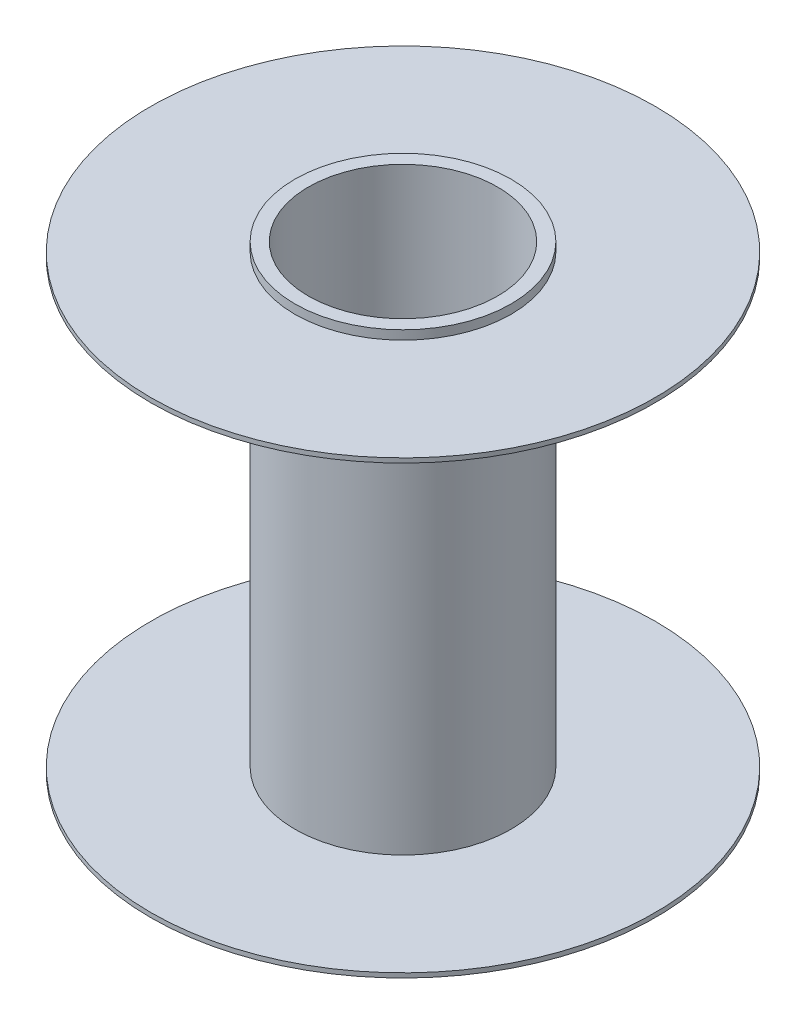
ISO-10303-21;
HEADER;
FILE_DESCRIPTION(('STEP AP214'),'2;1');
FILE_NAME('part.step','',(''),(''),'','','');
FILE_SCHEMA(('AUTOMOTIVE_DESIGN { 1 0 10303 214 1 1 1 1 }'));
ENDSEC;
DATA;
#1=APPLICATION_CONTEXT('core data for automotive mechanical design processes');
#2=APPLICATION_PROTOCOL_DEFINITION('international standard','automotive_design',2000,#1);
#3=PRODUCT_CONTEXT('',#1,'mechanical');
#4=PRODUCT('Part','Part','',(#3));
#5=PRODUCT_RELATED_PRODUCT_CATEGORY('part','',(#4));
#6=PRODUCT_DEFINITION_FORMATION('','',#4);
#7=PRODUCT_DEFINITION_CONTEXT('part definition',#1,'design');
#8=PRODUCT_DEFINITION('design','',#6,#7);
#9=PRODUCT_DEFINITION_SHAPE('','',#8);
#10=(LENGTH_UNIT() NAMED_UNIT(*) SI_UNIT(.MILLI.,.METRE.));
#11=(NAMED_UNIT(*) PLANE_ANGLE_UNIT() SI_UNIT($,.RADIAN.));
#12=(NAMED_UNIT(*) SI_UNIT($,.STERADIAN.) SOLID_ANGLE_UNIT());
#13=UNCERTAINTY_MEASURE_WITH_UNIT(LENGTH_MEASURE(1.E-05),#10,'distance_accuracy_value','');
#14=(GEOMETRIC_REPRESENTATION_CONTEXT(3) GLOBAL_UNCERTAINTY_ASSIGNED_CONTEXT((#13)) GLOBAL_UNIT_ASSIGNED_CONTEXT((#10,
#11,#12)) REPRESENTATION_CONTEXT('',''));
#15=CARTESIAN_POINT('',(0.,0.,0.));
#16=DIRECTION('',(0.,0.,1.));
#17=DIRECTION('',(1.,0.,0.));
#18=AXIS2_PLACEMENT_3D('',#15,#16,#17);
#19=CARTESIAN_POINT('',(0.,0.2,0.));
#20=DIRECTION('',(0.,-1.,0.));
#21=DIRECTION('',(0.,0.,-1.));
#22=AXIS2_PLACEMENT_3D('',#19,#20,#21);
#23=CYLINDRICAL_SURFACE('',#22,2.4);
#24=CARTESIAN_POINT('',(0.,0.2,0.));
#25=DIRECTION('',(0.,1.,0.));
#26=DIRECTION('',(0.,0.,1.));
#27=AXIS2_PLACEMENT_3D('',#24,#25,#26);
#28=CIRCLE('',#27,2.4);
#29=CARTESIAN_POINT('',(0.,0.2,2.4));
#30=VERTEX_POINT('',#29);
#31=EDGE_CURVE('E39',#30,#30,#28,.T.);
#32=ORIENTED_EDGE('',*,*,#31,.F.);
#33=EDGE_LOOP('',(#32));
#34=FACE_BOUND('',#33,.T.);
#35=CARTESIAN_POINT('',(0.,0.,0.));
#36=DIRECTION('',(0.,-1.,0.));
#37=DIRECTION('',(0.,0.,-1.));
#38=AXIS2_PLACEMENT_3D('',#35,#36,#37);
#39=CIRCLE('',#38,2.4);
#40=CARTESIAN_POINT('',(0.,0.,-2.4));
#41=VERTEX_POINT('',#40);
#42=EDGE_CURVE('E10',#41,#41,#39,.T.);
#43=ORIENTED_EDGE('',*,*,#42,.F.);
#44=EDGE_LOOP('',(#43));
#45=FACE_BOUND('',#44,.T.);
#46=ADVANCED_FACE('F31',(#34,#45),#23,.T.);
#47=CARTESIAN_POINT('',(0.,0.2,0.));
#48=DIRECTION('',(0.,1.,0.));
#49=DIRECTION('',(0.,0.,1.));
#50=AXIS2_PLACEMENT_3D('',#47,#48,#49);
#51=PLANE('',#50);
#52=ORIENTED_EDGE('',*,*,#31,.T.);
#53=EDGE_LOOP('',(#52));
#54=FACE_BOUND('',#53,.T.);
#55=CARTESIAN_POINT('',(0.,0.2,0.));
#56=DIRECTION('',(0.,1.,0.));
#57=DIRECTION('',(0.,0.,1.));
#58=AXIS2_PLACEMENT_3D('',#55,#56,#57);
#59=CIRCLE('',#58,2.1);
#60=CARTESIAN_POINT('',(0.,0.2,2.1));
#61=VERTEX_POINT('',#60);
#62=EDGE_CURVE('E43',#61,#61,#59,.T.);
#63=ORIENTED_EDGE('',*,*,#62,.F.);
#64=EDGE_LOOP('',(#63));
#65=FACE_BOUND('',#64,.T.);
#66=ADVANCED_FACE('F92',(#54,#65),#51,.T.);
#67=CARTESIAN_POINT('',(0.,-0.1,0.));
#68=DIRECTION('',(0.,-1.,0.));
#69=DIRECTION('',(0.,0.,-1.));
#70=AXIS2_PLACEMENT_3D('',#67,#68,#69);
#71=CIRCLE('',#70,2.4);
#72=CARTESIAN_POINT('',(0.,-0.1,-2.4));
#73=VERTEX_POINT('',#72);
#74=EDGE_CURVE('E35',#73,#73,#71,.T.);
#75=ORIENTED_EDGE('',*,*,#74,.T.);
#76=EDGE_LOOP('',(#75));
#77=FACE_BOUND('',#76,.T.);
#78=CARTESIAN_POINT('',(0.,-9.9,0.));
#79=DIRECTION('',(0.,-1.,0.));
#80=DIRECTION('',(0.,0.,-1.));
#81=AXIS2_PLACEMENT_3D('',#78,#79,#80);
#82=CIRCLE('',#81,2.4);
#83=CARTESIAN_POINT('',(0.,-9.9,-2.4));
#84=VERTEX_POINT('',#83);
#85=EDGE_CURVE('E55',#84,#84,#82,.T.);
#86=ORIENTED_EDGE('',*,*,#85,.F.);
#87=EDGE_LOOP('',(#86));
#88=FACE_BOUND('',#87,.T.);
#89=ADVANCED_FACE('F33',(#77,#88),#23,.T.);
#90=CARTESIAN_POINT('',(0.,0.2,0.));
#91=DIRECTION('',(0.,-1.,0.));
#92=DIRECTION('',(0.,0.,-1.));
#93=AXIS2_PLACEMENT_3D('',#90,#91,#92);
#94=CYLINDRICAL_SURFACE('',#93,2.1);
#95=ORIENTED_EDGE('',*,*,#62,.T.);
#96=EDGE_LOOP('',(#95));
#97=FACE_BOUND('',#96,.T.);
#98=CARTESIAN_POINT('',(0.,-10.2,0.));
#99=DIRECTION('',(0.,1.,0.));
#100=DIRECTION('',(0.,0.,1.));
#101=AXIS2_PLACEMENT_3D('',#98,#99,#100);
#102=CIRCLE('',#101,2.1);
#103=CARTESIAN_POINT('',(0.,-10.2,2.1));
#104=VERTEX_POINT('',#103);
#105=EDGE_CURVE('E58',#104,#104,#102,.T.);
#106=ORIENTED_EDGE('',*,*,#105,.F.);
#107=EDGE_LOOP('',(#106));
#108=FACE_BOUND('',#107,.T.);
#109=ADVANCED_FACE('F101',(#97,#108),#94,.F.);
#110=CARTESIAN_POINT('',(0.,-0.1,0.));
#111=DIRECTION('',(0.,-1.,0.));
#112=DIRECTION('',(0.,0.,-1.));
#113=AXIS2_PLACEMENT_3D('',#110,#111,#112);
#114=PLANE('',#113);
#115=ORIENTED_EDGE('',*,*,#74,.F.);
#116=EDGE_LOOP('',(#115));
#117=FACE_BOUND('',#116,.T.);
#118=CARTESIAN_POINT('',(0.,-0.1,0.));
#119=DIRECTION('',(0.,-1.,0.));
#120=DIRECTION('',(0.,0.,-1.));
#121=AXIS2_PLACEMENT_3D('',#118,#119,#120);
#122=CIRCLE('',#121,5.6);
#123=CARTESIAN_POINT('',(0.,-0.1,-5.6));
#124=VERTEX_POINT('',#123);
#125=EDGE_CURVE('E51',#124,#124,#122,.T.);
#126=ORIENTED_EDGE('',*,*,#125,.T.);
#127=EDGE_LOOP('',(#126));
#128=FACE_BOUND('',#127,.T.);
#129=ADVANCED_FACE('F106',(#117,#128),#114,.T.);
#130=CARTESIAN_POINT('',(0.,0.,0.));
#131=DIRECTION('',(0.,-1.,0.));
#132=DIRECTION('',(0.,0.,-1.));
#133=AXIS2_PLACEMENT_3D('',#130,#131,#132);
#134=PLANE('',#133);
#135=ORIENTED_EDGE('',*,*,#42,.T.);
#136=EDGE_LOOP('',(#135));
#137=FACE_BOUND('',#136,.T.);
#138=CARTESIAN_POINT('',(0.,0.,0.));
#139=DIRECTION('',(0.,-1.,0.));
#140=DIRECTION('',(0.,0.,-1.));
#141=AXIS2_PLACEMENT_3D('',#138,#139,#140);
#142=CIRCLE('',#141,5.6);
#143=CARTESIAN_POINT('',(0.,0.,-5.6));
#144=VERTEX_POINT('',#143);
#145=EDGE_CURVE('E48',#144,#144,#142,.T.);
#146=ORIENTED_EDGE('',*,*,#145,.F.);
#147=EDGE_LOOP('',(#146));
#148=FACE_BOUND('',#147,.T.);
#149=ADVANCED_FACE('F116',(#137,#148),#134,.F.);
#150=CARTESIAN_POINT('',(0.,-0.1,0.));
#151=DIRECTION('',(0.,1.,0.));
#152=DIRECTION('',(0.,0.,1.));
#153=AXIS2_PLACEMENT_3D('',#150,#151,#152);
#154=CYLINDRICAL_SURFACE('',#153,5.6);
#155=ORIENTED_EDGE('',*,*,#125,.F.);
#156=EDGE_LOOP('',(#155));
#157=FACE_BOUND('',#156,.T.);
#158=ORIENTED_EDGE('',*,*,#145,.T.);
#159=EDGE_LOOP('',(#158));
#160=FACE_BOUND('',#159,.T.);
#161=ADVANCED_FACE('F120',(#157,#160),#154,.T.);
#162=CARTESIAN_POINT('',(0.,-10.2,0.));
#163=DIRECTION('',(0.,1.,0.));
#164=DIRECTION('',(0.,0.,-1.));
#165=AXIS2_PLACEMENT_3D('',#162,#163,#164);
#166=CYLINDRICAL_SURFACE('',#165,2.4);
#167=CARTESIAN_POINT('',(0.,-10.2,0.));
#168=DIRECTION('',(0.,1.,0.));
#169=DIRECTION('',(0.,0.,1.));
#170=AXIS2_PLACEMENT_3D('',#167,#168,#169);
#171=CIRCLE('',#170,2.4);
#172=CARTESIAN_POINT('',(0.,-10.2,2.4));
#173=VERTEX_POINT('',#172);
#174=EDGE_CURVE('E62',#173,#173,#171,.T.);
#175=ORIENTED_EDGE('',*,*,#174,.T.);
#176=EDGE_LOOP('',(#175));
#177=FACE_BOUND('',#176,.T.);
#178=CARTESIAN_POINT('',(0.,-10.,0.));
#179=DIRECTION('',(0.,-1.,0.));
#180=DIRECTION('',(0.,0.,-1.));
#181=AXIS2_PLACEMENT_3D('',#178,#179,#180);
#182=CIRCLE('',#181,2.4);
#183=CARTESIAN_POINT('',(0.,-10.,-2.4));
#184=VERTEX_POINT('',#183);
#185=EDGE_CURVE('E52',#184,#184,#182,.T.);
#186=ORIENTED_EDGE('',*,*,#185,.T.);
#187=EDGE_LOOP('',(#186));
#188=FACE_BOUND('',#187,.T.);
#189=ADVANCED_FACE('F88',(#177,#188),#166,.T.);
#190=CARTESIAN_POINT('',(0.,-10.2,0.));
#191=DIRECTION('',(0.,-1.,0.));
#192=DIRECTION('',(0.,0.,1.));
#193=AXIS2_PLACEMENT_3D('',#190,#191,#192);
#194=PLANE('',#193);
#195=ORIENTED_EDGE('',*,*,#174,.F.);
#196=EDGE_LOOP('',(#195));
#197=FACE_BOUND('',#196,.T.);
#198=ORIENTED_EDGE('',*,*,#105,.T.);
#199=EDGE_LOOP('',(#198));
#200=FACE_BOUND('',#199,.T.);
#201=ADVANCED_FACE('F79',(#197,#200),#194,.T.);
#202=CARTESIAN_POINT('',(0.,-9.9,0.));
#203=DIRECTION('',(0.,1.,0.));
#204=DIRECTION('',(0.,0.,-1.));
#205=AXIS2_PLACEMENT_3D('',#202,#203,#204);
#206=PLANE('',#205);
#207=ORIENTED_EDGE('',*,*,#85,.T.);
#208=EDGE_LOOP('',(#207));
#209=FACE_BOUND('',#208,.T.);
#210=CARTESIAN_POINT('',(0.,-9.9,0.));
#211=DIRECTION('',(0.,-1.,0.));
#212=DIRECTION('',(0.,0.,-1.));
#213=AXIS2_PLACEMENT_3D('',#210,#211,#212);
#214=CIRCLE('',#213,5.6);
#215=CARTESIAN_POINT('',(0.,-9.9,-5.6));
#216=VERTEX_POINT('',#215);
#217=EDGE_CURVE('E59',#216,#216,#214,.T.);
#218=ORIENTED_EDGE('',*,*,#217,.F.);
#219=EDGE_LOOP('',(#218));
#220=FACE_BOUND('',#219,.T.);
#221=ADVANCED_FACE('F76',(#209,#220),#206,.T.);
#222=CARTESIAN_POINT('',(0.,-10.,0.));
#223=DIRECTION('',(0.,1.,0.));
#224=DIRECTION('',(0.,0.,-1.));
#225=AXIS2_PLACEMENT_3D('',#222,#223,#224);
#226=PLANE('',#225);
#227=ORIENTED_EDGE('',*,*,#185,.F.);
#228=EDGE_LOOP('',(#227));
#229=FACE_BOUND('',#228,.T.);
#230=CARTESIAN_POINT('',(0.,-10.,0.));
#231=DIRECTION('',(0.,-1.,0.));
#232=DIRECTION('',(0.,0.,-1.));
#233=AXIS2_PLACEMENT_3D('',#230,#231,#232);
#234=CIRCLE('',#233,5.6);
#235=CARTESIAN_POINT('',(0.,-10.,-5.6));
#236=VERTEX_POINT('',#235);
#237=EDGE_CURVE('E67',#236,#236,#234,.T.);
#238=ORIENTED_EDGE('',*,*,#237,.T.);
#239=EDGE_LOOP('',(#238));
#240=FACE_BOUND('',#239,.T.);
#241=ADVANCED_FACE('F78',(#229,#240),#226,.F.);
#242=CARTESIAN_POINT('',(0.,-9.9,0.));
#243=DIRECTION('',(0.,-1.,0.));
#244=DIRECTION('',(0.,0.,1.));
#245=AXIS2_PLACEMENT_3D('',#242,#243,#244);
#246=CYLINDRICAL_SURFACE('',#245,5.6);
#247=ORIENTED_EDGE('',*,*,#217,.T.);
#248=EDGE_LOOP('',(#247));
#249=FACE_BOUND('',#248,.T.);
#250=ORIENTED_EDGE('',*,*,#237,.F.);
#251=EDGE_LOOP('',(#250));
#252=FACE_BOUND('',#251,.T.);
#253=ADVANCED_FACE('F73',(#249,#252),#246,.T.);
#254=CLOSED_SHELL('',(#46,#66,#89,#109,#129,#149,#161,#189,#201,#221,#241,#253));
#255=MANIFOLD_SOLID_BREP('B2',#254);
#256=ADVANCED_BREP_SHAPE_REPRESENTATION('',(#18,#255),#14);
#257=SHAPE_DEFINITION_REPRESENTATION(#9,#256);
ENDSEC;
END-ISO-10303-21;
